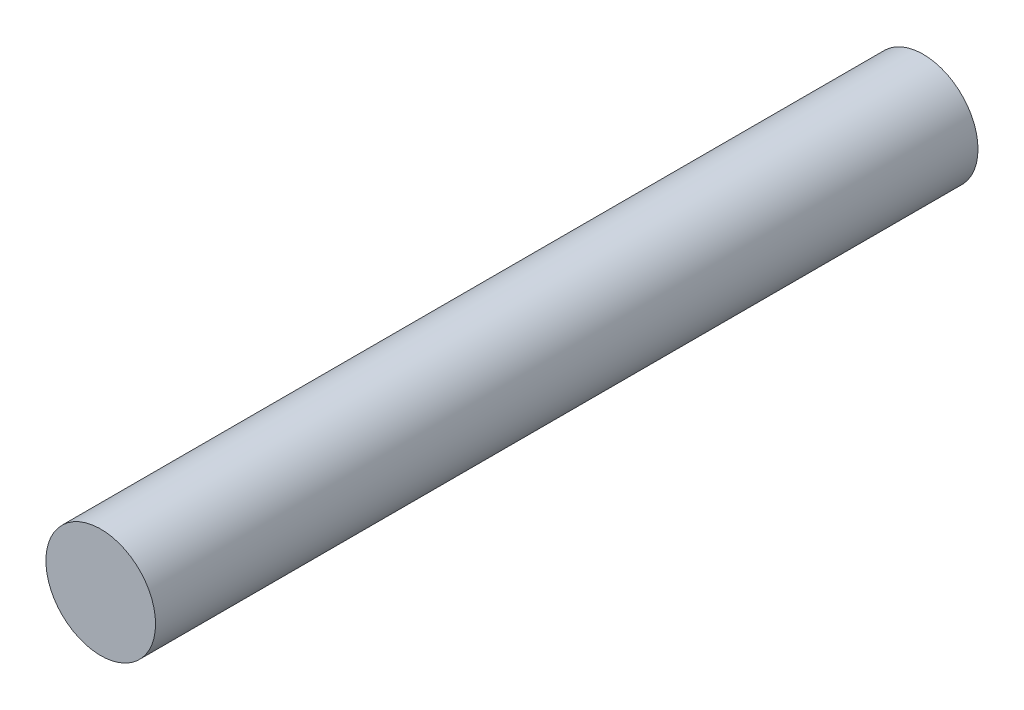
ISO-10303-21;
HEADER;
FILE_DESCRIPTION(('STEP AP214'),'2;1');
FILE_NAME('part.step','',(''),(''),'','','');
FILE_SCHEMA(('AUTOMOTIVE_DESIGN { 1 0 10303 214 1 1 1 1 }'));
ENDSEC;
DATA;
#1=APPLICATION_CONTEXT('core data for automotive mechanical design processes');
#2=APPLICATION_PROTOCOL_DEFINITION('international standard','automotive_design',2000,#1);
#3=PRODUCT_CONTEXT('',#1,'mechanical');
#4=PRODUCT('Part','Part','',(#3));
#5=PRODUCT_RELATED_PRODUCT_CATEGORY('part','',(#4));
#6=PRODUCT_DEFINITION_FORMATION('','',#4);
#7=PRODUCT_DEFINITION_CONTEXT('part definition',#1,'design');
#8=PRODUCT_DEFINITION('design','',#6,#7);
#9=PRODUCT_DEFINITION_SHAPE('','',#8);
#10=(LENGTH_UNIT() NAMED_UNIT(*) SI_UNIT(.MILLI.,.METRE.));
#11=(NAMED_UNIT(*) PLANE_ANGLE_UNIT() SI_UNIT($,.RADIAN.));
#12=(NAMED_UNIT(*) SI_UNIT($,.STERADIAN.) SOLID_ANGLE_UNIT());
#13=UNCERTAINTY_MEASURE_WITH_UNIT(LENGTH_MEASURE(1.E-05),#10,'distance_accuracy_value','');
#14=(GEOMETRIC_REPRESENTATION_CONTEXT(3) GLOBAL_UNCERTAINTY_ASSIGNED_CONTEXT((#13)) GLOBAL_UNIT_ASSIGNED_CONTEXT((#10,
#11,#12)) REPRESENTATION_CONTEXT('',''));
#15=CARTESIAN_POINT('',(0.,0.,0.));
#16=DIRECTION('',(0.,0.,1.));
#17=DIRECTION('',(1.,0.,0.));
#18=AXIS2_PLACEMENT_3D('',#15,#16,#17);
#19=CARTESIAN_POINT('',(0.,0.,150.));
#20=DIRECTION('',(0.,0.,-1.));
#21=DIRECTION('',(-1.,0.,0.));
#22=AXIS2_PLACEMENT_3D('',#19,#20,#21);
#23=CYLINDRICAL_SURFACE('',#22,10.);
#24=CARTESIAN_POINT('',(0.,0.,150.));
#25=DIRECTION('',(0.,0.,1.));
#26=DIRECTION('',(1.,0.,0.));
#27=AXIS2_PLACEMENT_3D('',#24,#25,#26);
#28=CIRCLE('',#27,10.);
#29=CARTESIAN_POINT('',(10.,0.,150.));
#30=VERTEX_POINT('',#29);
#31=EDGE_CURVE('E10',#30,#30,#28,.T.);
#32=ORIENTED_EDGE('',*,*,#31,.F.);
#33=EDGE_LOOP('',(#32));
#34=FACE_BOUND('',#33,.T.);
#35=CARTESIAN_POINT('',(0.,0.,0.));
#36=DIRECTION('',(0.,0.,1.));
#37=DIRECTION('',(1.,0.,0.));
#38=AXIS2_PLACEMENT_3D('',#35,#36,#37);
#39=CIRCLE('',#38,10.);
#40=CARTESIAN_POINT('',(10.,0.,0.));
#41=VERTEX_POINT('',#40);
#42=EDGE_CURVE('E44',#41,#41,#39,.T.);
#43=ORIENTED_EDGE('',*,*,#42,.T.);
#44=EDGE_LOOP('',(#43));
#45=FACE_BOUND('',#44,.T.);
#46=ADVANCED_FACE('F41',(#34,#45),#23,.T.);
#47=CARTESIAN_POINT('',(0.,0.,150.));
#48=DIRECTION('',(0.,0.,1.));
#49=DIRECTION('',(1.,0.,0.));
#50=AXIS2_PLACEMENT_3D('',#47,#48,#49);
#51=PLANE('',#50);
#52=ORIENTED_EDGE('',*,*,#31,.T.);
#53=EDGE_LOOP('',(#52));
#54=FACE_BOUND('',#53,.T.);
#55=ADVANCED_FACE('F74',(#54),#51,.T.);
#56=CARTESIAN_POINT('',(0.,0.,0.));
#57=DIRECTION('',(0.,0.,1.));
#58=DIRECTION('',(1.,0.,0.));
#59=AXIS2_PLACEMENT_3D('',#56,#57,#58);
#60=PLANE('',#59);
#61=CARTESIAN_POINT('',(0.,0.,0.));
#62=DIRECTION('',(0.,0.,-1.));
#63=DIRECTION('',(-1.,0.,0.));
#64=AXIS2_PLACEMENT_3D('',#61,#62,#63);
#65=CIRCLE('',#64,5.);
#66=CARTESIAN_POINT('',(-5.,0.,0.));
#67=VERTEX_POINT('',#66);
#68=EDGE_CURVE('E55',#67,#67,#65,.T.);
#69=ORIENTED_EDGE('',*,*,#68,.F.);
#70=EDGE_LOOP('',(#69));
#71=FACE_BOUND('',#70,.T.);
#72=ORIENTED_EDGE('',*,*,#42,.F.);
#73=EDGE_LOOP('',(#72));
#74=FACE_BOUND('',#73,.T.);
#75=ADVANCED_FACE('F68',(#71,#74),#60,.F.);
#76=CARTESIAN_POINT('',(0.,0.,123.));
#77=DIRECTION('',(0.,0.,-1.));
#78=DIRECTION('',(-1.,0.,0.));
#79=AXIS2_PLACEMENT_3D('',#76,#77,#78);
#80=CYLINDRICAL_SURFACE('',#79,5.);
#81=CARTESIAN_POINT('',(0.,0.,123.));
#82=DIRECTION('',(0.,0.,-1.));
#83=DIRECTION('',(-1.,0.,0.));
#84=AXIS2_PLACEMENT_3D('',#81,#82,#83);
#85=CIRCLE('',#84,5.);
#86=CARTESIAN_POINT('',(-5.,0.,123.));
#87=VERTEX_POINT('',#86);
#88=EDGE_CURVE('E53',#87,#87,#85,.T.);
#89=ORIENTED_EDGE('',*,*,#88,.F.);
#90=EDGE_LOOP('',(#89));
#91=FACE_BOUND('',#90,.T.);
#92=ORIENTED_EDGE('',*,*,#68,.T.);
#93=EDGE_LOOP('',(#92));
#94=FACE_BOUND('',#93,.T.);
#95=ADVANCED_FACE('F65',(#91,#94),#80,.F.);
#96=CARTESIAN_POINT('',(0.,0.,123.));
#97=DIRECTION('',(0.,0.,-1.));
#98=DIRECTION('',(-1.,0.,0.));
#99=AXIS2_PLACEMENT_3D('',#96,#97,#98);
#100=PLANE('',#99);
#101=ORIENTED_EDGE('',*,*,#88,.T.);
#102=EDGE_LOOP('',(#101));
#103=FACE_BOUND('',#102,.T.);
#104=ADVANCED_FACE('F63',(#103),#100,.T.);
#105=CLOSED_SHELL('',(#46,#55,#75,#95,#104));
#106=MANIFOLD_SOLID_BREP('B2',#105);
#107=ADVANCED_BREP_SHAPE_REPRESENTATION('',(#18,#106),#14);
#108=SHAPE_DEFINITION_REPRESENTATION(#9,#107);
ENDSEC;
END-ISO-10303-21;
